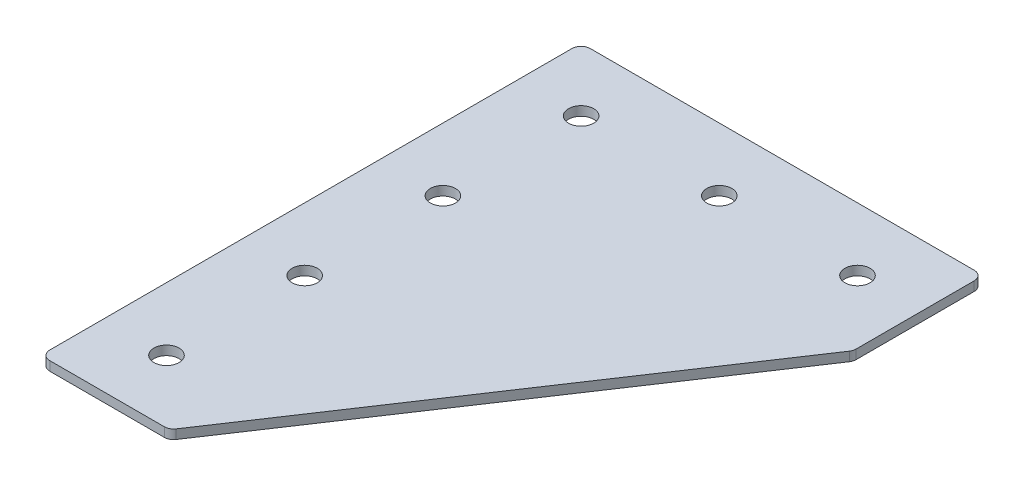
ISO-10303-21;
HEADER;
FILE_DESCRIPTION(('STEP AP214'),'2;1');
FILE_NAME('part.step','',(''),(''),'','','');
FILE_SCHEMA(('AUTOMOTIVE_DESIGN { 1 0 10303 214 1 1 1 1 }'));
ENDSEC;
DATA;
#1=APPLICATION_CONTEXT('core data for automotive mechanical design processes');
#2=APPLICATION_PROTOCOL_DEFINITION('international standard','automotive_design',2000,#1);
#3=PRODUCT_CONTEXT('',#1,'mechanical');
#4=PRODUCT('Part','Part','',(#3));
#5=PRODUCT_RELATED_PRODUCT_CATEGORY('part','',(#4));
#6=PRODUCT_DEFINITION_FORMATION('','',#4);
#7=PRODUCT_DEFINITION_CONTEXT('part definition',#1,'design');
#8=PRODUCT_DEFINITION('design','',#6,#7);
#9=PRODUCT_DEFINITION_SHAPE('','',#8);
#10=(LENGTH_UNIT() NAMED_UNIT(*) SI_UNIT(.MILLI.,.METRE.));
#11=(NAMED_UNIT(*) PLANE_ANGLE_UNIT() SI_UNIT($,.RADIAN.));
#12=(NAMED_UNIT(*) SI_UNIT($,.STERADIAN.) SOLID_ANGLE_UNIT());
#13=UNCERTAINTY_MEASURE_WITH_UNIT(LENGTH_MEASURE(1.E-05),#10,'distance_accuracy_value','');
#14=(GEOMETRIC_REPRESENTATION_CONTEXT(3) GLOBAL_UNCERTAINTY_ASSIGNED_CONTEXT((#13)) GLOBAL_UNIT_ASSIGNED_CONTEXT((#10,
#11,#12)) REPRESENTATION_CONTEXT('',''));
#15=CARTESIAN_POINT('',(0.,0.,0.));
#16=DIRECTION('',(0.,0.,1.));
#17=DIRECTION('',(1.,0.,0.));
#18=AXIS2_PLACEMENT_3D('',#15,#16,#17);
#19=CARTESIAN_POINT('',(-46.1789107907703,-0.091846607325806,-67.7290137563818));
#20=DIRECTION('',(0.,-1.,0.));
#21=DIRECTION('',(0.,0.,-1.));
#22=AXIS2_PLACEMENT_3D('',#19,#20,#21);
#23=PLANE('',#22);
#24=CARTESIAN_POINT('',(-46.1789107907703,-0.091846607325806,67.2709862436182));
#25=DIRECTION('',(0.,1.,0.));
#26=DIRECTION('',(0.,0.,1.));
#27=AXIS2_PLACEMENT_3D('',#24,#25,#26);
#28=CIRCLE('',#27,4.1);
#29=CARTESIAN_POINT('',(-46.1789107907703,-0.091846607325806,71.3709862436182));
#30=VERTEX_POINT('',#29);
#31=EDGE_CURVE('E253',#30,#30,#28,.T.);
#32=ORIENTED_EDGE('',*,*,#31,.T.);
#33=EDGE_LOOP('',(#32));
#34=FACE_BOUND('',#33,.T.);
#35=CARTESIAN_POINT('',(43.8210892092297,-0.091846607325806,-67.7290137563818));
#36=DIRECTION('',(0.,1.,0.));
#37=DIRECTION('',(0.,0.,1.));
#38=AXIS2_PLACEMENT_3D('',#35,#36,#37);
#39=CIRCLE('',#38,4.09999999999999);
#40=CARTESIAN_POINT('',(43.8210892092297,-0.091846607325806,-63.6290137563818));
#41=VERTEX_POINT('',#40);
#42=EDGE_CURVE('E261',#41,#41,#39,.T.);
#43=ORIENTED_EDGE('',*,*,#42,.T.);
#44=EDGE_LOOP('',(#43));
#45=FACE_BOUND('',#44,.T.);
#46=CARTESIAN_POINT('',(-46.1789107907703,-0.091846607325806,22.2709862436182));
#47=DIRECTION('',(0.,1.,0.));
#48=DIRECTION('',(0.,0.,1.));
#49=AXIS2_PLACEMENT_3D('',#46,#47,#48);
#50=CIRCLE('',#49,4.1);
#51=CARTESIAN_POINT('',(-46.1789107907703,-0.091846607325806,26.3709862436182));
#52=VERTEX_POINT('',#51);
#53=EDGE_CURVE('E267',#52,#52,#50,.T.);
#54=ORIENTED_EDGE('',*,*,#53,.T.);
#55=EDGE_LOOP('',(#54));
#56=FACE_BOUND('',#55,.T.);
#57=CARTESIAN_POINT('',(-46.1789107907703,-0.091846607325806,-22.7290137563818));
#58=DIRECTION('',(0.,1.,0.));
#59=DIRECTION('',(0.,0.,1.));
#60=AXIS2_PLACEMENT_3D('',#57,#58,#59);
#61=CIRCLE('',#60,4.1);
#62=CARTESIAN_POINT('',(-46.1789107907703,-0.091846607325806,-18.6290137563818));
#63=VERTEX_POINT('',#62);
#64=EDGE_CURVE('E273',#63,#63,#61,.T.);
#65=ORIENTED_EDGE('',*,*,#64,.T.);
#66=EDGE_LOOP('',(#65));
#67=FACE_BOUND('',#66,.T.);
#68=CARTESIAN_POINT('',(-1.17891079077027,-0.091846607325806,-67.7290137563818));
#69=DIRECTION('',(0.,1.,0.));
#70=DIRECTION('',(0.,0.,1.));
#71=AXIS2_PLACEMENT_3D('',#68,#69,#70);
#72=CIRCLE('',#71,4.1);
#73=CARTESIAN_POINT('',(-1.17891079077027,-0.091846607325806,-63.6290137563818));
#74=VERTEX_POINT('',#73);
#75=EDGE_CURVE('E279',#74,#74,#72,.T.);
#76=ORIENTED_EDGE('',*,*,#75,.T.);
#77=EDGE_LOOP('',(#76));
#78=FACE_BOUND('',#77,.T.);
#79=CARTESIAN_POINT('',(-46.1789107907703,-0.091846607325806,-67.7290137563818));
#80=DIRECTION('',(0.,1.,0.));
#81=DIRECTION('',(0.,0.,1.));
#82=AXIS2_PLACEMENT_3D('',#79,#80,#81);
#83=CIRCLE('',#82,4.1);
#84=CARTESIAN_POINT('',(-46.1789107907703,-0.091846607325806,-63.6290137563818));
#85=VERTEX_POINT('',#84);
#86=EDGE_CURVE('E176',#85,#85,#83,.T.);
#87=ORIENTED_EDGE('',*,*,#86,.T.);
#88=EDGE_LOOP('',(#87));
#89=FACE_BOUND('',#88,.T.);
#90=DIRECTION('',(1.,0.,0.));
#91=VECTOR('',#90,1.);
#92=CARTESIAN_POINT('',(-66.6789107907702,-0.091846607325806,87.7709862436182));
#93=LINE('',#92,#91);
#94=CARTESIAN_POINT('',(-63.6789107907703,-0.091846607325806,87.7709862436182));
#95=VERTEX_POINT('',#94);
#96=CARTESIAN_POINT('',(-26.3548295832103,-0.091846607325806,87.7709862436182));
#97=VERTEX_POINT('',#96);
#98=EDGE_CURVE('E165',#95,#97,#93,.T.);
#99=ORIENTED_EDGE('',*,*,#98,.F.);
#100=CARTESIAN_POINT('',(-63.6789107907703,-0.091846607325806,84.7709862436182));
#101=DIRECTION('',(0.,-1.,0.));
#102=DIRECTION('',(0.,0.,-1.));
#103=AXIS2_PLACEMENT_3D('',#100,#101,#102);
#104=CIRCLE('',#103,3.);
#105=CARTESIAN_POINT('',(-66.6789107907702,-0.091846607325806,84.7709862436182));
#106=VERTEX_POINT('',#105);
#107=EDGE_CURVE('E146',#95,#106,#104,.T.);
#108=ORIENTED_EDGE('',*,*,#107,.T.);
#109=DIRECTION('',(0.,0.,1.));
#110=VECTOR('',#109,1.);
#111=CARTESIAN_POINT('',(-66.6789107907703,-0.091846607325806,-88.2290137563818));
#112=LINE('',#111,#110);
#113=CARTESIAN_POINT('',(-66.6789107907703,-0.091846607325806,-85.2290137563818));
#114=VERTEX_POINT('',#113);
#115=EDGE_CURVE('E163',#114,#106,#112,.T.);
#116=ORIENTED_EDGE('',*,*,#115,.F.);
#117=CARTESIAN_POINT('',(-63.6789107907703,-0.091846607325806,-85.2290137563818));
#118=DIRECTION('',(0.,-1.,0.));
#119=DIRECTION('',(0.,0.,-1.));
#120=AXIS2_PLACEMENT_3D('',#117,#118,#119);
#121=CIRCLE('',#120,3.);
#122=CARTESIAN_POINT('',(-63.6789107907703,-0.091846607325806,-88.2290137563818));
#123=VERTEX_POINT('',#122);
#124=EDGE_CURVE('E117',#114,#123,#121,.T.);
#125=ORIENTED_EDGE('',*,*,#124,.T.);
#126=DIRECTION('',(-1.,0.,0.));
#127=VECTOR('',#126,1.);
#128=CARTESIAN_POINT('',(64.3210892092297,-0.091846607325806,-88.2290137563819));
#129=LINE('',#128,#127);
#130=CARTESIAN_POINT('',(61.3210892092297,-0.091846607325806,-88.2290137563819));
#131=VERTEX_POINT('',#130);
#132=EDGE_CURVE('E161',#131,#123,#129,.T.);
#133=ORIENTED_EDGE('',*,*,#132,.F.);
#134=CARTESIAN_POINT('',(61.3210892092297,-0.091846607325806,-85.2290137563819));
#135=DIRECTION('',(0.,-1.,0.));
#136=DIRECTION('',(0.,0.,-1.));
#137=AXIS2_PLACEMENT_3D('',#134,#135,#136);
#138=CIRCLE('',#137,3.);
#139=CARTESIAN_POINT('',(64.3210892092297,-0.091846607325806,-85.2290137563819));
#140=VERTEX_POINT('',#139);
#141=EDGE_CURVE('E141',#131,#140,#138,.T.);
#142=ORIENTED_EDGE('',*,*,#141,.T.);
#143=DIRECTION('',(0.,0.,-1.));
#144=VECTOR('',#143,1.);
#145=CARTESIAN_POINT('',(64.3210892092297,-0.091846607325806,-45.8345650318458));
#146=LINE('',#145,#144);
#147=CARTESIAN_POINT('',(64.3210892092297,-0.091846607325806,-46.7428919450418));
#148=VERTEX_POINT('',#147);
#149=EDGE_CURVE('E118',#148,#140,#146,.T.);
#150=ORIENTED_EDGE('',*,*,#149,.F.);
#151=CARTESIAN_POINT('',(61.3210892092297,-0.091846607325806,-46.7428919450418));
#152=DIRECTION('',(0.,-1.,0.));
#153=DIRECTION('',(0.,0.,-1.));
#154=AXIS2_PLACEMENT_3D('',#151,#152,#153);
#155=CIRCLE('',#154,3.);
#156=CARTESIAN_POINT('',(63.8172400922433,-0.091846607325806,-45.0787913563661));
#157=VERTEX_POINT('',#156);
#158=EDGE_CURVE('E31',#148,#157,#155,.T.);
#159=ORIENTED_EDGE('',*,*,#158,.T.);
#160=DIRECTION('',(0.554700196225229,0.,-0.832050294337843));
#161=VECTOR('',#160,1.);
#162=CARTESIAN_POINT('',(-24.7492783077463,-0.091846607325806,87.7709862436182));
#163=LINE('',#162,#161);
#164=CARTESIAN_POINT('',(-23.8586787001967,-0.091846607325806,86.4350868322938));
#165=VERTEX_POINT('',#164);
#166=EDGE_CURVE('E122',#165,#157,#163,.T.);
#167=ORIENTED_EDGE('',*,*,#166,.F.);
#168=CARTESIAN_POINT('',(-26.3548295832103,-0.091846607325806,84.7709862436182));
#169=DIRECTION('',(0.,-1.,0.));
#170=DIRECTION('',(0.,0.,-1.));
#171=AXIS2_PLACEMENT_3D('',#168,#169,#170);
#172=CIRCLE('',#171,3.);
#173=EDGE_CURVE('E144',#165,#97,#172,.T.);
#174=ORIENTED_EDGE('',*,*,#173,.T.);
#175=EDGE_LOOP('',(#99,#108,#116,#125,#133,#142,#150,#159,#167,#174));
#176=FACE_BOUND('',#175,.T.);
#177=ADVANCED_FACE('F16',(#34,#45,#56,#67,#78,#89,#176),#23,.T.);
#178=CARTESIAN_POINT('',(64.3210892092297,-0.091846607325806,-88.2290137563819));
#179=DIRECTION('',(0.,0.,-1.));
#180=DIRECTION('',(-1.,0.,0.));
#181=AXIS2_PLACEMENT_3D('',#178,#179,#180);
#182=PLANE('',#181);
#183=DIRECTION('',(-1.,0.,0.));
#184=VECTOR('',#183,1.);
#185=CARTESIAN_POINT('',(64.3210892092297,2.90815339267419,-88.2290137563819));
#186=LINE('',#185,#184);
#187=CARTESIAN_POINT('',(61.3210892092297,2.90815339267419,-88.2290137563819));
#188=VERTEX_POINT('',#187);
#189=CARTESIAN_POINT('',(-63.6789107907703,2.90815339267419,-88.2290137563818));
#190=VERTEX_POINT('',#189);
#191=EDGE_CURVE('E99',#188,#190,#186,.T.);
#192=ORIENTED_EDGE('',*,*,#191,.F.);
#193=DIRECTION('',(0.,1.,0.));
#194=VECTOR('',#193,1.);
#195=CARTESIAN_POINT('',(61.3210892092297,-0.091846607325806,-88.2290137563819));
#196=LINE('',#195,#194);
#197=EDGE_CURVE('E10',#188,#131,#196,.F.);
#198=ORIENTED_EDGE('',*,*,#197,.T.);
#199=ORIENTED_EDGE('',*,*,#132,.T.);
#200=DIRECTION('',(0.,1.,0.));
#201=VECTOR('',#200,1.);
#202=CARTESIAN_POINT('',(-63.6789107907703,-0.091846607325806,-88.2290137563818));
#203=LINE('',#202,#201);
#204=EDGE_CURVE('E24',#123,#190,#203,.T.);
#205=ORIENTED_EDGE('',*,*,#204,.T.);
#206=EDGE_LOOP('',(#192,#198,#199,#205));
#207=FACE_BOUND('',#206,.T.);
#208=ADVANCED_FACE('F158',(#207),#182,.T.);
#209=CARTESIAN_POINT('',(64.3210892092297,-0.091846607325806,-45.8345650318458));
#210=DIRECTION('',(1.,0.,0.));
#211=DIRECTION('',(0.,0.,-1.));
#212=AXIS2_PLACEMENT_3D('',#209,#210,#211);
#213=PLANE('',#212);
#214=DIRECTION('',(0.,0.,-1.));
#215=VECTOR('',#214,1.);
#216=CARTESIAN_POINT('',(64.3210892092297,2.90815339267419,-45.8345650318458));
#217=LINE('',#216,#215);
#218=CARTESIAN_POINT('',(64.3210892092297,2.90815339267419,-46.7428919450418));
#219=VERTEX_POINT('',#218);
#220=CARTESIAN_POINT('',(64.3210892092297,2.90815339267419,-85.2290137563819));
#221=VERTEX_POINT('',#220);
#222=EDGE_CURVE('E125',#219,#221,#217,.T.);
#223=ORIENTED_EDGE('',*,*,#222,.F.);
#224=DIRECTION('',(0.,1.,0.));
#225=VECTOR('',#224,1.);
#226=CARTESIAN_POINT('',(64.3210892092297,-0.091846607325806,-46.7428919450418));
#227=LINE('',#226,#225);
#228=EDGE_CURVE('E155',#219,#148,#227,.F.);
#229=ORIENTED_EDGE('',*,*,#228,.T.);
#230=ORIENTED_EDGE('',*,*,#149,.T.);
#231=DIRECTION('',(0.,1.,0.));
#232=VECTOR('',#231,1.);
#233=CARTESIAN_POINT('',(64.3210892092297,-0.091846607325806,-85.2290137563819));
#234=LINE('',#233,#232);
#235=EDGE_CURVE('E152',#140,#221,#234,.T.);
#236=ORIENTED_EDGE('',*,*,#235,.T.);
#237=EDGE_LOOP('',(#223,#229,#230,#236));
#238=FACE_BOUND('',#237,.T.);
#239=ADVANCED_FACE('F212',(#238),#213,.T.);
#240=CARTESIAN_POINT('',(-24.7492783077463,-0.091846607325806,87.7709862436182));
#241=DIRECTION('',(0.832050294337844,0.,0.554700196225229));
#242=DIRECTION('',(0.554700196225229,0.,-0.832050294337843));
#243=AXIS2_PLACEMENT_3D('',#240,#241,#242);
#244=PLANE('',#243);
#245=DIRECTION('',(0.554700196225229,0.,-0.832050294337843));
#246=VECTOR('',#245,1.);
#247=CARTESIAN_POINT('',(-24.7492783077463,2.90815339267419,87.7709862436182));
#248=LINE('',#247,#246);
#249=CARTESIAN_POINT('',(-23.8586787001967,2.90815339267419,86.4350868322938));
#250=VERTEX_POINT('',#249);
#251=CARTESIAN_POINT('',(63.8172400922433,2.90815339267419,-45.0787913563661));
#252=VERTEX_POINT('',#251);
#253=EDGE_CURVE('E168',#250,#252,#248,.T.);
#254=ORIENTED_EDGE('',*,*,#253,.F.);
#255=DIRECTION('',(0.,1.,0.));
#256=VECTOR('',#255,1.);
#257=CARTESIAN_POINT('',(-23.8586787001967,-0.091846607325806,86.4350868322938));
#258=LINE('',#257,#256);
#259=EDGE_CURVE('E38',#250,#165,#258,.F.);
#260=ORIENTED_EDGE('',*,*,#259,.T.);
#261=ORIENTED_EDGE('',*,*,#166,.T.);
#262=DIRECTION('',(0.,1.,0.));
#263=VECTOR('',#262,1.);
#264=CARTESIAN_POINT('',(63.8172400922433,-0.091846607325806,-45.0787913563662));
#265=LINE('',#264,#263);
#266=EDGE_CURVE('E148',#157,#252,#265,.T.);
#267=ORIENTED_EDGE('',*,*,#266,.T.);
#268=EDGE_LOOP('',(#254,#260,#261,#267));
#269=FACE_BOUND('',#268,.T.);
#270=ADVANCED_FACE('F181',(#269),#244,.T.);
#271=CARTESIAN_POINT('',(-66.6789107907702,-0.091846607325806,87.7709862436182));
#272=DIRECTION('',(0.,0.,1.));
#273=DIRECTION('',(1.,0.,0.));
#274=AXIS2_PLACEMENT_3D('',#271,#272,#273);
#275=PLANE('',#274);
#276=DIRECTION('',(1.,0.,0.));
#277=VECTOR('',#276,1.);
#278=CARTESIAN_POINT('',(-66.6789107907702,2.90815339267419,87.7709862436182));
#279=LINE('',#278,#277);
#280=CARTESIAN_POINT('',(-63.6789107907703,2.90815339267419,87.7709862436182));
#281=VERTEX_POINT('',#280);
#282=CARTESIAN_POINT('',(-26.3548295832103,2.90815339267419,87.7709862436182));
#283=VERTEX_POINT('',#282);
#284=EDGE_CURVE('E114',#281,#283,#279,.T.);
#285=ORIENTED_EDGE('',*,*,#284,.F.);
#286=DIRECTION('',(0.,1.,0.));
#287=VECTOR('',#286,1.);
#288=CARTESIAN_POINT('',(-63.6789107907703,-0.091846607325806,87.7709862436182));
#289=LINE('',#288,#287);
#290=EDGE_CURVE('E138',#281,#95,#289,.F.);
#291=ORIENTED_EDGE('',*,*,#290,.T.);
#292=ORIENTED_EDGE('',*,*,#98,.T.);
#293=DIRECTION('',(0.,1.,0.));
#294=VECTOR('',#293,1.);
#295=CARTESIAN_POINT('',(-26.3548295832103,-0.091846607325806,87.7709862436182));
#296=LINE('',#295,#294);
#297=EDGE_CURVE('E135',#97,#283,#296,.T.);
#298=ORIENTED_EDGE('',*,*,#297,.T.);
#299=EDGE_LOOP('',(#285,#291,#292,#298));
#300=FACE_BOUND('',#299,.T.);
#301=ADVANCED_FACE('F191',(#300),#275,.T.);
#302=CARTESIAN_POINT('',(-66.6789107907703,-0.091846607325806,-88.2290137563818));
#303=DIRECTION('',(-1.,0.,0.));
#304=DIRECTION('',(0.,0.,1.));
#305=AXIS2_PLACEMENT_3D('',#302,#303,#304);
#306=PLANE('',#305);
#307=ORIENTED_EDGE('',*,*,#115,.T.);
#308=DIRECTION('',(0.,1.,0.));
#309=VECTOR('',#308,1.);
#310=CARTESIAN_POINT('',(-66.6789107907702,-0.091846607325806,84.7709862436182));
#311=LINE('',#310,#309);
#312=CARTESIAN_POINT('',(-66.6789107907702,2.90815339267419,84.7709862436182));
#313=VERTEX_POINT('',#312);
#314=EDGE_CURVE('E105',#106,#313,#311,.T.);
#315=ORIENTED_EDGE('',*,*,#314,.T.);
#316=DIRECTION('',(0.,0.,1.));
#317=VECTOR('',#316,1.);
#318=CARTESIAN_POINT('',(-66.6789107907703,2.90815339267419,-88.2290137563818));
#319=LINE('',#318,#317);
#320=CARTESIAN_POINT('',(-66.6789107907703,2.90815339267419,-85.2290137563818));
#321=VERTEX_POINT('',#320);
#322=EDGE_CURVE('E97',#321,#313,#319,.T.);
#323=ORIENTED_EDGE('',*,*,#322,.F.);
#324=DIRECTION('',(0.,1.,0.));
#325=VECTOR('',#324,1.);
#326=CARTESIAN_POINT('',(-66.6789107907703,-0.091846607325806,-85.2290137563818));
#327=LINE('',#326,#325);
#328=EDGE_CURVE('E111',#321,#114,#327,.F.);
#329=ORIENTED_EDGE('',*,*,#328,.T.);
#330=EDGE_LOOP('',(#307,#315,#323,#329));
#331=FACE_BOUND('',#330,.T.);
#332=ADVANCED_FACE('F110',(#331),#306,.T.);
#333=CARTESIAN_POINT('',(-46.1789107907703,2.90815339267419,-67.7290137563818));
#334=DIRECTION('',(0.,-1.,0.));
#335=DIRECTION('',(0.,0.,-1.));
#336=AXIS2_PLACEMENT_3D('',#333,#334,#335);
#337=PLANE('',#336);
#338=CARTESIAN_POINT('',(-46.1789107907703,2.90815339267419,67.2709862436182));
#339=DIRECTION('',(0.,1.,0.));
#340=DIRECTION('',(0.,0.,1.));
#341=AXIS2_PLACEMENT_3D('',#338,#339,#340);
#342=CIRCLE('',#341,4.1);
#343=CARTESIAN_POINT('',(-46.1789107907703,2.90815339267419,71.3709862436182));
#344=VERTEX_POINT('',#343);
#345=EDGE_CURVE('E256',#344,#344,#342,.T.);
#346=ORIENTED_EDGE('',*,*,#345,.F.);
#347=EDGE_LOOP('',(#346));
#348=FACE_BOUND('',#347,.T.);
#349=CARTESIAN_POINT('',(43.8210892092297,2.90815339267419,-67.7290137563818));
#350=DIRECTION('',(0.,1.,0.));
#351=DIRECTION('',(0.,0.,1.));
#352=AXIS2_PLACEMENT_3D('',#349,#350,#351);
#353=CIRCLE('',#352,4.09999999999999);
#354=CARTESIAN_POINT('',(43.8210892092297,2.90815339267419,-63.6290137563818));
#355=VERTEX_POINT('',#354);
#356=EDGE_CURVE('E258',#355,#355,#353,.T.);
#357=ORIENTED_EDGE('',*,*,#356,.F.);
#358=EDGE_LOOP('',(#357));
#359=FACE_BOUND('',#358,.T.);
#360=CARTESIAN_POINT('',(-46.1789107907703,2.90815339267419,22.2709862436182));
#361=DIRECTION('',(0.,1.,0.));
#362=DIRECTION('',(0.,0.,1.));
#363=AXIS2_PLACEMENT_3D('',#360,#361,#362);
#364=CIRCLE('',#363,4.1);
#365=CARTESIAN_POINT('',(-46.1789107907703,2.90815339267419,26.3709862436182));
#366=VERTEX_POINT('',#365);
#367=EDGE_CURVE('E264',#366,#366,#364,.T.);
#368=ORIENTED_EDGE('',*,*,#367,.F.);
#369=EDGE_LOOP('',(#368));
#370=FACE_BOUND('',#369,.T.);
#371=CARTESIAN_POINT('',(-46.1789107907703,2.90815339267419,-22.7290137563818));
#372=DIRECTION('',(0.,1.,0.));
#373=DIRECTION('',(0.,0.,1.));
#374=AXIS2_PLACEMENT_3D('',#371,#372,#373);
#375=CIRCLE('',#374,4.1);
#376=CARTESIAN_POINT('',(-46.1789107907703,2.90815339267419,-18.6290137563818));
#377=VERTEX_POINT('',#376);
#378=EDGE_CURVE('E270',#377,#377,#375,.T.);
#379=ORIENTED_EDGE('',*,*,#378,.F.);
#380=EDGE_LOOP('',(#379));
#381=FACE_BOUND('',#380,.T.);
#382=CARTESIAN_POINT('',(-1.17891079077027,2.90815339267419,-67.7290137563818));
#383=DIRECTION('',(0.,1.,0.));
#384=DIRECTION('',(0.,0.,1.));
#385=AXIS2_PLACEMENT_3D('',#382,#383,#384);
#386=CIRCLE('',#385,4.1);
#387=CARTESIAN_POINT('',(-1.17891079077027,2.90815339267419,-63.6290137563818));
#388=VERTEX_POINT('',#387);
#389=EDGE_CURVE('E276',#388,#388,#386,.T.);
#390=ORIENTED_EDGE('',*,*,#389,.F.);
#391=EDGE_LOOP('',(#390));
#392=FACE_BOUND('',#391,.T.);
#393=CARTESIAN_POINT('',(-46.1789107907703,2.90815339267419,-67.7290137563818));
#394=DIRECTION('',(0.,1.,0.));
#395=DIRECTION('',(0.,0.,1.));
#396=AXIS2_PLACEMENT_3D('',#393,#394,#395);
#397=CIRCLE('',#396,4.1);
#398=CARTESIAN_POINT('',(-46.1789107907703,2.90815339267419,-63.6290137563818));
#399=VERTEX_POINT('',#398);
#400=EDGE_CURVE('E170',#399,#399,#397,.T.);
#401=ORIENTED_EDGE('',*,*,#400,.F.);
#402=EDGE_LOOP('',(#401));
#403=FACE_BOUND('',#402,.T.);
#404=ORIENTED_EDGE('',*,*,#322,.T.);
#405=CARTESIAN_POINT('',(-63.6789107907703,2.90815339267419,84.7709862436182));
#406=DIRECTION('',(0.,-1.,0.));
#407=DIRECTION('',(0.,0.,-1.));
#408=AXIS2_PLACEMENT_3D('',#405,#406,#407);
#409=CIRCLE('',#408,3.);
#410=EDGE_CURVE('E133',#313,#281,#409,.F.);
#411=ORIENTED_EDGE('',*,*,#410,.T.);
#412=ORIENTED_EDGE('',*,*,#284,.T.);
#413=CARTESIAN_POINT('',(-26.3548295832103,2.90815339267419,84.7709862436182));
#414=DIRECTION('',(0.,-1.,0.));
#415=DIRECTION('',(0.,0.,-1.));
#416=AXIS2_PLACEMENT_3D('',#413,#414,#415);
#417=CIRCLE('',#416,3.);
#418=EDGE_CURVE('E131',#283,#250,#417,.F.);
#419=ORIENTED_EDGE('',*,*,#418,.T.);
#420=ORIENTED_EDGE('',*,*,#253,.T.);
#421=CARTESIAN_POINT('',(61.3210892092297,2.90815339267419,-46.7428919450418));
#422=DIRECTION('',(0.,-1.,0.));
#423=DIRECTION('',(0.,0.,-1.));
#424=AXIS2_PLACEMENT_3D('',#421,#422,#423);
#425=CIRCLE('',#424,3.);
#426=EDGE_CURVE('E129',#252,#219,#425,.F.);
#427=ORIENTED_EDGE('',*,*,#426,.T.);
#428=ORIENTED_EDGE('',*,*,#222,.T.);
#429=CARTESIAN_POINT('',(61.3210892092297,2.90815339267419,-85.2290137563819));
#430=DIRECTION('',(0.,-1.,0.));
#431=DIRECTION('',(0.,0.,-1.));
#432=AXIS2_PLACEMENT_3D('',#429,#430,#431);
#433=CIRCLE('',#432,3.);
#434=EDGE_CURVE('E104',#221,#188,#433,.F.);
#435=ORIENTED_EDGE('',*,*,#434,.T.);
#436=ORIENTED_EDGE('',*,*,#191,.T.);
#437=CARTESIAN_POINT('',(-63.6789107907703,2.90815339267419,-85.2290137563818));
#438=DIRECTION('',(0.,-1.,0.));
#439=DIRECTION('',(0.,0.,-1.));
#440=AXIS2_PLACEMENT_3D('',#437,#438,#439);
#441=CIRCLE('',#440,3.);
#442=EDGE_CURVE('E94',#190,#321,#441,.F.);
#443=ORIENTED_EDGE('',*,*,#442,.T.);
#444=EDGE_LOOP('',(#404,#411,#412,#419,#420,#427,#428,#435,#436,#443));
#445=FACE_BOUND('',#444,.T.);
#446=ADVANCED_FACE('F96',(#348,#359,#370,#381,#392,#403,#445),#337,.F.);
#447=CARTESIAN_POINT('',(-63.6789107907703,-0.091846607325806,84.7709862436182));
#448=DIRECTION('',(0.,1.,0.));
#449=DIRECTION('',(0.,0.,1.));
#450=AXIS2_PLACEMENT_3D('',#447,#448,#449);
#451=CYLINDRICAL_SURFACE('',#450,3.);
#452=ORIENTED_EDGE('',*,*,#107,.F.);
#453=ORIENTED_EDGE('',*,*,#290,.F.);
#454=ORIENTED_EDGE('',*,*,#410,.F.);
#455=ORIENTED_EDGE('',*,*,#314,.F.);
#456=EDGE_LOOP('',(#452,#453,#454,#455));
#457=FACE_BOUND('',#456,.T.);
#458=ADVANCED_FACE('F194',(#457),#451,.T.);
#459=CARTESIAN_POINT('',(-26.3548295832103,-0.091846607325806,84.7709862436182));
#460=DIRECTION('',(0.,1.,0.));
#461=DIRECTION('',(0.,0.,1.));
#462=AXIS2_PLACEMENT_3D('',#459,#460,#461);
#463=CYLINDRICAL_SURFACE('',#462,3.);
#464=ORIENTED_EDGE('',*,*,#173,.F.);
#465=ORIENTED_EDGE('',*,*,#259,.F.);
#466=ORIENTED_EDGE('',*,*,#418,.F.);
#467=ORIENTED_EDGE('',*,*,#297,.F.);
#468=EDGE_LOOP('',(#464,#465,#466,#467));
#469=FACE_BOUND('',#468,.T.);
#470=ADVANCED_FACE('F185',(#469),#463,.T.);
#471=CARTESIAN_POINT('',(61.3210892092297,-0.091846607325806,-46.7428919450418));
#472=DIRECTION('',(0.,1.,0.));
#473=DIRECTION('',(0.,0.,1.));
#474=AXIS2_PLACEMENT_3D('',#471,#472,#473);
#475=CYLINDRICAL_SURFACE('',#474,3.);
#476=ORIENTED_EDGE('',*,*,#158,.F.);
#477=ORIENTED_EDGE('',*,*,#228,.F.);
#478=ORIENTED_EDGE('',*,*,#426,.F.);
#479=ORIENTED_EDGE('',*,*,#266,.F.);
#480=EDGE_LOOP('',(#476,#477,#478,#479));
#481=FACE_BOUND('',#480,.T.);
#482=ADVANCED_FACE('F202',(#481),#475,.T.);
#483=CARTESIAN_POINT('',(61.3210892092297,-0.091846607325806,-85.2290137563819));
#484=DIRECTION('',(0.,1.,0.));
#485=DIRECTION('',(0.,0.,1.));
#486=AXIS2_PLACEMENT_3D('',#483,#484,#485);
#487=CYLINDRICAL_SURFACE('',#486,3.);
#488=ORIENTED_EDGE('',*,*,#141,.F.);
#489=ORIENTED_EDGE('',*,*,#197,.F.);
#490=ORIENTED_EDGE('',*,*,#434,.F.);
#491=ORIENTED_EDGE('',*,*,#235,.F.);
#492=EDGE_LOOP('',(#488,#489,#490,#491));
#493=FACE_BOUND('',#492,.T.);
#494=ADVANCED_FACE('F337',(#493),#487,.T.);
#495=CARTESIAN_POINT('',(-63.6789107907703,-0.091846607325806,-85.2290137563818));
#496=DIRECTION('',(0.,1.,0.));
#497=DIRECTION('',(0.,0.,1.));
#498=AXIS2_PLACEMENT_3D('',#495,#496,#497);
#499=CYLINDRICAL_SURFACE('',#498,3.);
#500=ORIENTED_EDGE('',*,*,#124,.F.);
#501=ORIENTED_EDGE('',*,*,#328,.F.);
#502=ORIENTED_EDGE('',*,*,#442,.F.);
#503=ORIENTED_EDGE('',*,*,#204,.F.);
#504=EDGE_LOOP('',(#500,#501,#502,#503));
#505=FACE_BOUND('',#504,.T.);
#506=ADVANCED_FACE('F18',(#505),#499,.T.);
#507=CARTESIAN_POINT('',(-46.1789107907703,-0.091846607325806,-67.7290137563818));
#508=DIRECTION('',(0.,1.,0.));
#509=DIRECTION('',(0.,0.,1.));
#510=AXIS2_PLACEMENT_3D('',#507,#508,#509);
#511=CYLINDRICAL_SURFACE('',#510,4.1);
#512=ORIENTED_EDGE('',*,*,#86,.F.);
#513=EDGE_LOOP('',(#512));
#514=FACE_BOUND('',#513,.T.);
#515=ORIENTED_EDGE('',*,*,#400,.T.);
#516=EDGE_LOOP('',(#515));
#517=FACE_BOUND('',#516,.T.);
#518=ADVANCED_FACE('F226',(#514,#517),#511,.F.);
#519=CARTESIAN_POINT('',(-1.17891079077027,-0.091846607325806,-67.7290137563818));
#520=DIRECTION('',(0.,1.,0.));
#521=DIRECTION('',(0.,0.,1.));
#522=AXIS2_PLACEMENT_3D('',#519,#520,#521);
#523=CYLINDRICAL_SURFACE('',#522,4.1);
#524=ORIENTED_EDGE('',*,*,#75,.F.);
#525=EDGE_LOOP('',(#524));
#526=FACE_BOUND('',#525,.T.);
#527=ORIENTED_EDGE('',*,*,#389,.T.);
#528=EDGE_LOOP('',(#527));
#529=FACE_BOUND('',#528,.T.);
#530=ADVANCED_FACE('F229',(#526,#529),#523,.F.);
#531=CARTESIAN_POINT('',(-46.1789107907703,-0.091846607325806,-22.7290137563818));
#532=DIRECTION('',(0.,1.,0.));
#533=DIRECTION('',(0.,0.,1.));
#534=AXIS2_PLACEMENT_3D('',#531,#532,#533);
#535=CYLINDRICAL_SURFACE('',#534,4.1);
#536=ORIENTED_EDGE('',*,*,#64,.F.);
#537=EDGE_LOOP('',(#536));
#538=FACE_BOUND('',#537,.T.);
#539=ORIENTED_EDGE('',*,*,#378,.T.);
#540=EDGE_LOOP('',(#539));
#541=FACE_BOUND('',#540,.T.);
#542=ADVANCED_FACE('F233',(#538,#541),#535,.F.);
#543=CARTESIAN_POINT('',(-46.1789107907703,-0.091846607325806,22.2709862436182));
#544=DIRECTION('',(0.,1.,0.));
#545=DIRECTION('',(0.,0.,1.));
#546=AXIS2_PLACEMENT_3D('',#543,#544,#545);
#547=CYLINDRICAL_SURFACE('',#546,4.1);
#548=ORIENTED_EDGE('',*,*,#53,.F.);
#549=EDGE_LOOP('',(#548));
#550=FACE_BOUND('',#549,.T.);
#551=ORIENTED_EDGE('',*,*,#367,.T.);
#552=EDGE_LOOP('',(#551));
#553=FACE_BOUND('',#552,.T.);
#554=ADVANCED_FACE('F237',(#550,#553),#547,.F.);
#555=CARTESIAN_POINT('',(43.8210892092297,-0.091846607325806,-67.7290137563818));
#556=DIRECTION('',(0.,1.,0.));
#557=DIRECTION('',(0.,0.,1.));
#558=AXIS2_PLACEMENT_3D('',#555,#556,#557);
#559=CYLINDRICAL_SURFACE('',#558,4.09999999999999);
#560=ORIENTED_EDGE('',*,*,#42,.F.);
#561=EDGE_LOOP('',(#560));
#562=FACE_BOUND('',#561,.T.);
#563=ORIENTED_EDGE('',*,*,#356,.T.);
#564=EDGE_LOOP('',(#563));
#565=FACE_BOUND('',#564,.T.);
#566=ADVANCED_FACE('F241',(#562,#565),#559,.F.);
#567=CARTESIAN_POINT('',(-46.1789107907703,-0.091846607325806,67.2709862436182));
#568=DIRECTION('',(0.,1.,0.));
#569=DIRECTION('',(0.,0.,1.));
#570=AXIS2_PLACEMENT_3D('',#567,#568,#569);
#571=CYLINDRICAL_SURFACE('',#570,4.1);
#572=ORIENTED_EDGE('',*,*,#31,.F.);
#573=EDGE_LOOP('',(#572));
#574=FACE_BOUND('',#573,.T.);
#575=ORIENTED_EDGE('',*,*,#345,.T.);
#576=EDGE_LOOP('',(#575));
#577=FACE_BOUND('',#576,.T.);
#578=ADVANCED_FACE('F245',(#574,#577),#571,.F.);
#579=CLOSED_SHELL('',(#177,#208,#239,#270,#301,#332,#446,#458,#470,#482,#494,#506,#518,#530,
#542,#554,#566,#578));
#580=MANIFOLD_SOLID_BREP('B1',#579);
#581=ADVANCED_BREP_SHAPE_REPRESENTATION('',(#18,#580),#14);
#582=SHAPE_DEFINITION_REPRESENTATION(#9,#581);
ENDSEC;
END-ISO-10303-21;
